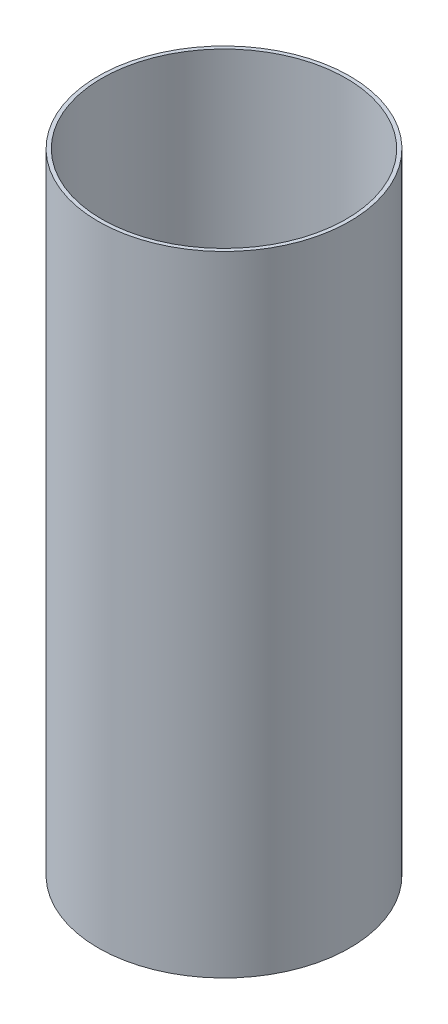
ISO-10303-21;
HEADER;
FILE_DESCRIPTION(('STEP AP214'),'2;1');
FILE_NAME('part.step','',(''),(''),'','','');
FILE_SCHEMA(('AUTOMOTIVE_DESIGN { 1 0 10303 214 1 1 1 1 }'));
ENDSEC;
DATA;
#1=APPLICATION_CONTEXT('core data for automotive mechanical design processes');
#2=APPLICATION_PROTOCOL_DEFINITION('international standard','automotive_design',2000,#1);
#3=PRODUCT_CONTEXT('',#1,'mechanical');
#4=PRODUCT('Part','Part','',(#3));
#5=PRODUCT_RELATED_PRODUCT_CATEGORY('part','',(#4));
#6=PRODUCT_DEFINITION_FORMATION('','',#4);
#7=PRODUCT_DEFINITION_CONTEXT('part definition',#1,'design');
#8=PRODUCT_DEFINITION('design','',#6,#7);
#9=PRODUCT_DEFINITION_SHAPE('','',#8);
#10=(LENGTH_UNIT() NAMED_UNIT(*) SI_UNIT(.MILLI.,.METRE.));
#11=(NAMED_UNIT(*) PLANE_ANGLE_UNIT() SI_UNIT($,.RADIAN.));
#12=(NAMED_UNIT(*) SI_UNIT($,.STERADIAN.) SOLID_ANGLE_UNIT());
#13=UNCERTAINTY_MEASURE_WITH_UNIT(LENGTH_MEASURE(1.E-05),#10,'distance_accuracy_value','');
#14=(GEOMETRIC_REPRESENTATION_CONTEXT(3) GLOBAL_UNCERTAINTY_ASSIGNED_CONTEXT((#13)) GLOBAL_UNIT_ASSIGNED_CONTEXT((#10,
#11,#12)) REPRESENTATION_CONTEXT('',''));
#15=CARTESIAN_POINT('',(0.,0.,0.));
#16=DIRECTION('',(0.,0.,1.));
#17=DIRECTION('',(1.,0.,0.));
#18=AXIS2_PLACEMENT_3D('',#15,#16,#17);
#19=CARTESIAN_POINT('',(1.09999999999999,26.,0.));
#20=DIRECTION('',(0.,1.,0.));
#21=DIRECTION('',(0.,0.,1.));
#22=AXIS2_PLACEMENT_3D('',#19,#20,#21);
#23=CYLINDRICAL_SURFACE('',#22,82.5);
#24=CARTESIAN_POINT('',(1.09999999999999,26.,0.));
#25=DIRECTION('',(0.,1.,0.));
#26=DIRECTION('',(0.,0.,1.));
#27=AXIS2_PLACEMENT_3D('',#24,#25,#26);
#28=CIRCLE('',#27,82.5);
#29=CARTESIAN_POINT('',(1.09999999999999,26.,82.5));
#30=VERTEX_POINT('',#29);
#31=EDGE_CURVE('E31',#30,#30,#28,.F.);
#32=ORIENTED_EDGE('',*,*,#31,.T.);
#33=EDGE_LOOP('',(#32));
#34=FACE_BOUND('',#33,.T.);
#35=CARTESIAN_POINT('',(1.09999999999999,451.,0.));
#36=DIRECTION('',(0.,1.,0.));
#37=DIRECTION('',(0.,0.,1.));
#38=AXIS2_PLACEMENT_3D('',#35,#36,#37);
#39=CIRCLE('',#38,82.5);
#40=CARTESIAN_POINT('',(1.09999999999999,451.,82.5));
#41=VERTEX_POINT('',#40);
#42=EDGE_CURVE('E18',#41,#41,#39,.F.);
#43=ORIENTED_EDGE('',*,*,#42,.F.);
#44=EDGE_LOOP('',(#43));
#45=FACE_BOUND('',#44,.T.);
#46=ADVANCED_FACE('F15',(#34,#45),#23,.F.);
#47=CARTESIAN_POINT('',(82.1508048099394,451.,-21.5787451483817));
#48=DIRECTION('',(0.,1.,0.));
#49=DIRECTION('',(0.,0.,1.));
#50=AXIS2_PLACEMENT_3D('',#47,#48,#49);
#51=PLANE('',#50);
#52=ORIENTED_EDGE('',*,*,#42,.T.);
#53=EDGE_LOOP('',(#52));
#54=FACE_BOUND('',#53,.T.);
#55=CARTESIAN_POINT('',(1.09999999999999,451.,0.));
#56=DIRECTION('',(0.,1.,0.));
#57=DIRECTION('',(0.,0.,1.));
#58=AXIS2_PLACEMENT_3D('',#55,#56,#57);
#59=CIRCLE('',#58,85.);
#60=CARTESIAN_POINT('',(1.09999999999999,451.,85.));
#61=VERTEX_POINT('',#60);
#62=EDGE_CURVE('E23',#61,#61,#59,.F.);
#63=ORIENTED_EDGE('',*,*,#62,.F.);
#64=EDGE_LOOP('',(#63));
#65=FACE_BOUND('',#64,.T.);
#66=ADVANCED_FACE('F40',(#54,#65),#51,.T.);
#67=CARTESIAN_POINT('',(82.1508048099394,26.,-21.5787451483817));
#68=DIRECTION('',(0.,1.,0.));
#69=DIRECTION('',(0.,0.,1.));
#70=AXIS2_PLACEMENT_3D('',#67,#68,#69);
#71=PLANE('',#70);
#72=ORIENTED_EDGE('',*,*,#31,.F.);
#73=EDGE_LOOP('',(#72));
#74=FACE_BOUND('',#73,.T.);
#75=CARTESIAN_POINT('',(1.09999999999999,26.,0.));
#76=DIRECTION('',(0.,1.,0.));
#77=DIRECTION('',(0.,0.,1.));
#78=AXIS2_PLACEMENT_3D('',#75,#76,#77);
#79=CIRCLE('',#78,85.);
#80=CARTESIAN_POINT('',(1.09999999999999,26.,85.));
#81=VERTEX_POINT('',#80);
#82=EDGE_CURVE('E10',#81,#81,#79,.T.);
#83=ORIENTED_EDGE('',*,*,#82,.F.);
#84=EDGE_LOOP('',(#83));
#85=FACE_BOUND('',#84,.T.);
#86=ADVANCED_FACE('F48',(#74,#85),#71,.F.);
#87=CARTESIAN_POINT('',(1.09999999999999,26.,0.));
#88=DIRECTION('',(0.,1.,0.));
#89=DIRECTION('',(0.,0.,1.));
#90=AXIS2_PLACEMENT_3D('',#87,#88,#89);
#91=CYLINDRICAL_SURFACE('',#90,85.);
#92=ORIENTED_EDGE('',*,*,#82,.T.);
#93=EDGE_LOOP('',(#92));
#94=FACE_BOUND('',#93,.T.);
#95=ORIENTED_EDGE('',*,*,#62,.T.);
#96=EDGE_LOOP('',(#95));
#97=FACE_BOUND('',#96,.T.);
#98=ADVANCED_FACE('F49',(#94,#97),#91,.T.);
#99=CLOSED_SHELL('',(#46,#66,#86,#98));
#100=MANIFOLD_SOLID_BREP('B1',#99);
#101=ADVANCED_BREP_SHAPE_REPRESENTATION('',(#18,#100),#14);
#102=SHAPE_DEFINITION_REPRESENTATION(#9,#101);
ENDSEC;
END-ISO-10303-21;
